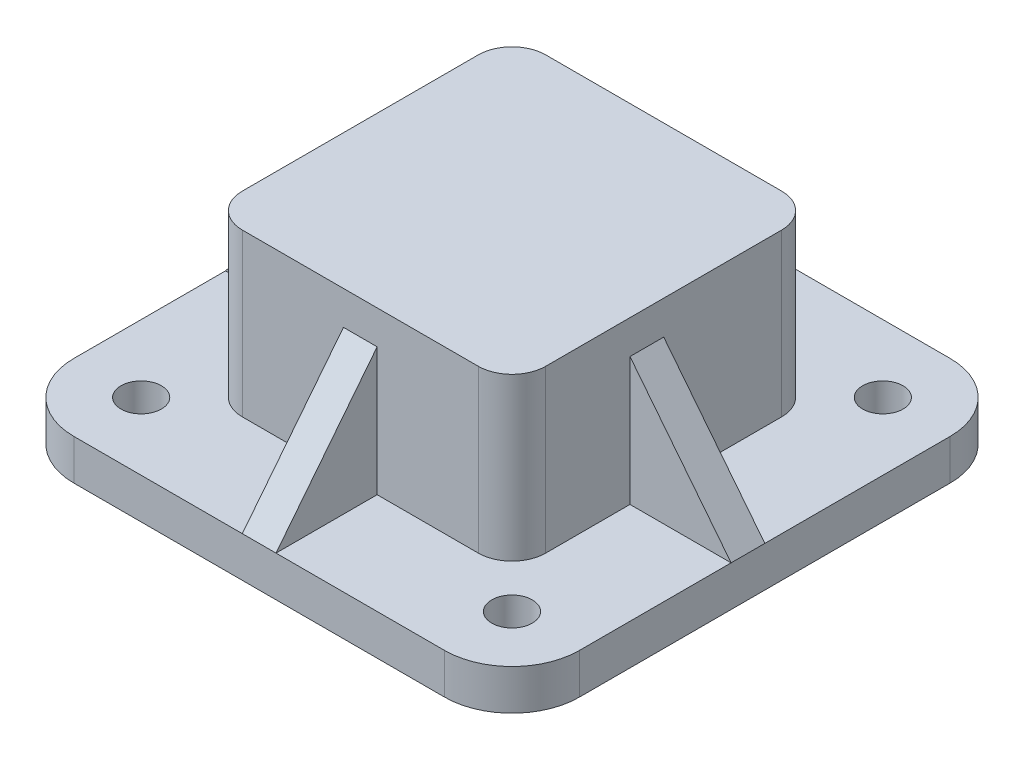
ISO-10303-21;
HEADER;
FILE_DESCRIPTION(('STEP AP214'),'2;1');
FILE_NAME('part.step','',(''),(''),'','','');
FILE_SCHEMA(('AUTOMOTIVE_DESIGN { 1 0 10303 214 1 1 1 1 }'));
ENDSEC;
DATA;
#1=APPLICATION_CONTEXT('core data for automotive mechanical design processes');
#2=APPLICATION_PROTOCOL_DEFINITION('international standard','automotive_design',2000,#1);
#3=PRODUCT_CONTEXT('',#1,'mechanical');
#4=PRODUCT('Part','Part','',(#3));
#5=PRODUCT_RELATED_PRODUCT_CATEGORY('part','',(#4));
#6=PRODUCT_DEFINITION_FORMATION('','',#4);
#7=PRODUCT_DEFINITION_CONTEXT('part definition',#1,'design');
#8=PRODUCT_DEFINITION('design','',#6,#7);
#9=PRODUCT_DEFINITION_SHAPE('','',#8);
#10=(LENGTH_UNIT() NAMED_UNIT(*) SI_UNIT(.MILLI.,.METRE.));
#11=(NAMED_UNIT(*) PLANE_ANGLE_UNIT() SI_UNIT($,.RADIAN.));
#12=(NAMED_UNIT(*) SI_UNIT($,.STERADIAN.) SOLID_ANGLE_UNIT());
#13=UNCERTAINTY_MEASURE_WITH_UNIT(LENGTH_MEASURE(1.E-05),#10,'distance_accuracy_value','');
#14=(GEOMETRIC_REPRESENTATION_CONTEXT(3) GLOBAL_UNCERTAINTY_ASSIGNED_CONTEXT((#13)) GLOBAL_UNIT_ASSIGNED_CONTEXT((#10,
#11,#12)) REPRESENTATION_CONTEXT('',''));
#15=CARTESIAN_POINT('',(0.,0.,0.));
#16=DIRECTION('',(0.,0.,1.));
#17=DIRECTION('',(1.,0.,0.));
#18=AXIS2_PLACEMENT_3D('',#15,#16,#17);
#19=CARTESIAN_POINT('',(55.,12.,-55.));
#20=DIRECTION('',(0.,1.,0.));
#21=DIRECTION('',(0.,0.,1.));
#22=AXIS2_PLACEMENT_3D('',#19,#20,#21);
#23=PLANE('',#22);
#24=CARTESIAN_POINT('',(-55.,12.,-55.));
#25=DIRECTION('',(0.,1.,0.));
#26=DIRECTION('',(0.,0.,1.));
#27=AXIS2_PLACEMENT_3D('',#24,#25,#26);
#28=CIRCLE('',#27,6.);
#29=CARTESIAN_POINT('',(-55.,12.,-49.));
#30=VERTEX_POINT('',#29);
#31=EDGE_CURVE('E398',#30,#30,#28,.T.);
#32=ORIENTED_EDGE('',*,*,#31,.F.);
#33=EDGE_LOOP('',(#32));
#34=FACE_BOUND('',#33,.T.);
#35=DIRECTION('',(0.,0.,1.));
#36=VECTOR('',#35,1.);
#37=CARTESIAN_POINT('',(-75.,12.,-54.9999999999998));
#38=LINE('',#37,#36);
#39=CARTESIAN_POINT('',(-75.,12.,-54.9999999999998));
#40=VERTEX_POINT('',#39);
#41=CARTESIAN_POINT('',(-75.,12.,0.));
#42=VERTEX_POINT('',#41);
#43=EDGE_CURVE('E234',#40,#42,#38,.T.);
#44=ORIENTED_EDGE('',*,*,#43,.T.);
#45=DIRECTION('',(-1.,0.,0.));
#46=VECTOR('',#45,1.);
#47=CARTESIAN_POINT('',(-45.,12.,0.));
#48=LINE('',#47,#46);
#49=CARTESIAN_POINT('',(-45.,12.,0.));
#50=VERTEX_POINT('',#49);
#51=EDGE_CURVE('E233',#50,#42,#48,.T.);
#52=ORIENTED_EDGE('',*,*,#51,.F.);
#53=DIRECTION('',(0.,0.,1.));
#54=VECTOR('',#53,1.);
#55=CARTESIAN_POINT('',(-45.,12.,-34.9999999999999));
#56=LINE('',#55,#54);
#57=CARTESIAN_POINT('',(-45.,12.,-34.9999999999999));
#58=VERTEX_POINT('',#57);
#59=EDGE_CURVE('E219',#58,#50,#56,.T.);
#60=ORIENTED_EDGE('',*,*,#59,.F.);
#61=CARTESIAN_POINT('',(-35.,12.,-35.));
#62=DIRECTION('',(0.,-1.,0.));
#63=DIRECTION('',(0.,0.,-1.));
#64=AXIS2_PLACEMENT_3D('',#61,#62,#63);
#65=CIRCLE('',#64,10.);
#66=CARTESIAN_POINT('',(-34.9999999999999,12.,-45.));
#67=VERTEX_POINT('',#66);
#68=EDGE_CURVE('E315',#58,#67,#65,.T.);
#69=ORIENTED_EDGE('',*,*,#68,.T.);
#70=DIRECTION('',(1.,0.,0.));
#71=VECTOR('',#70,1.);
#72=CARTESIAN_POINT('',(-34.9999999999999,12.,-45.));
#73=LINE('',#72,#71);
#74=CARTESIAN_POINT('',(-5.,12.,-45.));
#75=VERTEX_POINT('',#74);
#76=EDGE_CURVE('E338',#67,#75,#73,.T.);
#77=ORIENTED_EDGE('',*,*,#76,.T.);
#78=DIRECTION('',(0.,0.,-1.));
#79=VECTOR('',#78,1.);
#80=CARTESIAN_POINT('',(-5.,12.,-45.));
#81=LINE('',#80,#79);
#82=CARTESIAN_POINT('',(-5.,12.,-75.));
#83=VERTEX_POINT('',#82);
#84=EDGE_CURVE('E299',#75,#83,#81,.T.);
#85=ORIENTED_EDGE('',*,*,#84,.T.);
#86=DIRECTION('',(-1.,0.,0.));
#87=VECTOR('',#86,1.);
#88=CARTESIAN_POINT('',(-54.9999999999999,12.,-75.));
#89=LINE('',#88,#87);
#90=CARTESIAN_POINT('',(-55.,12.,-75.));
#91=VERTEX_POINT('',#90);
#92=EDGE_CURVE('E407',#83,#91,#89,.T.);
#93=ORIENTED_EDGE('',*,*,#92,.T.);
#94=CARTESIAN_POINT('',(-55.,12.,-55.));
#95=DIRECTION('',(0.,1.,0.));
#96=DIRECTION('',(0.,0.,-1.));
#97=AXIS2_PLACEMENT_3D('',#94,#95,#96);
#98=CIRCLE('',#97,20.);
#99=EDGE_CURVE('E412',#91,#40,#98,.T.);
#100=ORIENTED_EDGE('',*,*,#99,.T.);
#101=EDGE_LOOP('',(#44,#52,#60,#69,#77,#85,#93,#100));
#102=FACE_BOUND('',#101,.T.);
#103=ADVANCED_FACE('F33',(#34,#102),#23,.T.);
#104=CARTESIAN_POINT('',(55.,12.,-55.));
#105=DIRECTION('',(0.,1.,0.));
#106=DIRECTION('',(0.,0.,1.));
#107=AXIS2_PLACEMENT_3D('',#104,#105,#106);
#108=CIRCLE('',#107,6.);
#109=CARTESIAN_POINT('',(55.,12.,-49.));
#110=VERTEX_POINT('',#109);
#111=EDGE_CURVE('E380',#110,#110,#108,.T.);
#112=ORIENTED_EDGE('',*,*,#111,.F.);
#113=EDGE_LOOP('',(#112));
#114=FACE_BOUND('',#113,.T.);
#115=DIRECTION('',(0.,0.,1.));
#116=VECTOR('',#115,1.);
#117=CARTESIAN_POINT('',(45.,12.,-34.9999999999999));
#118=LINE('',#117,#116);
#119=CARTESIAN_POINT('',(45.,12.,-34.9999999999999));
#120=VERTEX_POINT('',#119);
#121=CARTESIAN_POINT('',(45.,12.,0.));
#122=VERTEX_POINT('',#121);
#123=EDGE_CURVE('E345',#120,#122,#118,.T.);
#124=ORIENTED_EDGE('',*,*,#123,.T.);
#125=DIRECTION('',(-1.,0.,0.));
#126=VECTOR('',#125,1.);
#127=CARTESIAN_POINT('',(75.,12.,0.));
#128=LINE('',#127,#126);
#129=CARTESIAN_POINT('',(75.,12.,0.));
#130=VERTEX_POINT('',#129);
#131=EDGE_CURVE('E258',#130,#122,#128,.T.);
#132=ORIENTED_EDGE('',*,*,#131,.F.);
#133=DIRECTION('',(0.,0.,-1.));
#134=VECTOR('',#133,1.);
#135=CARTESIAN_POINT('',(75.,12.,-54.9999999999998));
#136=LINE('',#135,#134);
#137=CARTESIAN_POINT('',(75.,12.,-54.9999999999998));
#138=VERTEX_POINT('',#137);
#139=EDGE_CURVE('E424',#130,#138,#136,.T.);
#140=ORIENTED_EDGE('',*,*,#139,.T.);
#141=CARTESIAN_POINT('',(55.,12.,-55.));
#142=DIRECTION('',(0.,1.,0.));
#143=DIRECTION('',(0.,0.,1.));
#144=AXIS2_PLACEMENT_3D('',#141,#142,#143);
#145=CIRCLE('',#144,20.);
#146=CARTESIAN_POINT('',(54.9999999999998,12.,-75.));
#147=VERTEX_POINT('',#146);
#148=EDGE_CURVE('E404',#138,#147,#145,.T.);
#149=ORIENTED_EDGE('',*,*,#148,.T.);
#150=CARTESIAN_POINT('',(5.,12.,-75.));
#151=VERTEX_POINT('',#150);
#152=EDGE_CURVE('E409',#147,#151,#89,.T.);
#153=ORIENTED_EDGE('',*,*,#152,.T.);
#154=DIRECTION('',(0.,0.,-1.));
#155=VECTOR('',#154,1.);
#156=CARTESIAN_POINT('',(5.,12.,-45.));
#157=LINE('',#156,#155);
#158=CARTESIAN_POINT('',(5.,12.,-45.));
#159=VERTEX_POINT('',#158);
#160=EDGE_CURVE('E302',#159,#151,#157,.T.);
#161=ORIENTED_EDGE('',*,*,#160,.F.);
#162=CARTESIAN_POINT('',(34.9999999999999,12.,-45.));
#163=VERTEX_POINT('',#162);
#164=EDGE_CURVE('E337',#159,#163,#73,.T.);
#165=ORIENTED_EDGE('',*,*,#164,.T.);
#166=CARTESIAN_POINT('',(35.,12.,-35.));
#167=DIRECTION('',(0.,1.,0.));
#168=DIRECTION('',(0.,0.,1.));
#169=AXIS2_PLACEMENT_3D('',#166,#167,#168);
#170=CIRCLE('',#169,10.);
#171=EDGE_CURVE('E341',#120,#163,#170,.T.);
#172=ORIENTED_EDGE('',*,*,#171,.F.);
#173=EDGE_LOOP('',(#124,#132,#140,#149,#153,#161,#165,#172));
#174=FACE_BOUND('',#173,.T.);
#175=ADVANCED_FACE('F515',(#114,#174),#23,.T.);
#176=DIRECTION('',(-1.,0.,0.));
#177=VECTOR('',#176,1.);
#178=CARTESIAN_POINT('',(75.,12.,10.));
#179=LINE('',#178,#177);
#180=CARTESIAN_POINT('',(75.,12.,10.));
#181=VERTEX_POINT('',#180);
#182=CARTESIAN_POINT('',(45.,12.,10.));
#183=VERTEX_POINT('',#182);
#184=EDGE_CURVE('E260',#181,#183,#179,.T.);
#185=ORIENTED_EDGE('',*,*,#184,.T.);
#186=CARTESIAN_POINT('',(45.,12.,34.9999999999999));
#187=VERTEX_POINT('',#186);
#188=EDGE_CURVE('E344',#183,#187,#118,.T.);
#189=ORIENTED_EDGE('',*,*,#188,.T.);
#190=CARTESIAN_POINT('',(35.,12.,35.));
#191=DIRECTION('',(0.,1.,0.));
#192=DIRECTION('',(0.,0.,1.));
#193=AXIS2_PLACEMENT_3D('',#190,#191,#192);
#194=CIRCLE('',#193,10.);
#195=CARTESIAN_POINT('',(35.,12.,45.));
#196=VERTEX_POINT('',#195);
#197=EDGE_CURVE('E348',#196,#187,#194,.T.);
#198=ORIENTED_EDGE('',*,*,#197,.F.);
#199=DIRECTION('',(1.,0.,0.));
#200=VECTOR('',#199,1.);
#201=CARTESIAN_POINT('',(-34.9999999999999,12.,45.));
#202=LINE('',#201,#200);
#203=CARTESIAN_POINT('',(5.,12.,45.));
#204=VERTEX_POINT('',#203);
#205=EDGE_CURVE('E351',#204,#196,#202,.T.);
#206=ORIENTED_EDGE('',*,*,#205,.F.);
#207=DIRECTION('',(0.,0.,-1.));
#208=VECTOR('',#207,1.);
#209=CARTESIAN_POINT('',(5.,12.,45.));
#210=LINE('',#209,#208);
#211=CARTESIAN_POINT('',(5.,12.,75.));
#212=VERTEX_POINT('',#211);
#213=EDGE_CURVE('E281',#212,#204,#210,.T.);
#214=ORIENTED_EDGE('',*,*,#213,.F.);
#215=DIRECTION('',(1.,0.,0.));
#216=VECTOR('',#215,1.);
#217=CARTESIAN_POINT('',(-54.9999999999999,12.,75.));
#218=LINE('',#217,#216);
#219=CARTESIAN_POINT('',(54.9999999999998,12.,75.));
#220=VERTEX_POINT('',#219);
#221=EDGE_CURVE('E418',#212,#220,#218,.T.);
#222=ORIENTED_EDGE('',*,*,#221,.T.);
#223=CARTESIAN_POINT('',(55.,12.,55.));
#224=DIRECTION('',(0.,1.,0.));
#225=DIRECTION('',(0.,0.,1.));
#226=AXIS2_PLACEMENT_3D('',#223,#224,#225);
#227=CIRCLE('',#226,20.);
#228=CARTESIAN_POINT('',(75.,12.,54.9999999999999));
#229=VERTEX_POINT('',#228);
#230=EDGE_CURVE('E422',#220,#229,#227,.T.);
#231=ORIENTED_EDGE('',*,*,#230,.T.);
#232=EDGE_CURVE('E425',#229,#181,#136,.T.);
#233=ORIENTED_EDGE('',*,*,#232,.T.);
#234=EDGE_LOOP('',(#185,#189,#198,#206,#214,#222,#231,#233));
#235=FACE_BOUND('',#234,.T.);
#236=CARTESIAN_POINT('',(55.,12.,55.));
#237=DIRECTION('',(0.,1.,0.));
#238=DIRECTION('',(0.,0.,1.));
#239=AXIS2_PLACEMENT_3D('',#236,#237,#238);
#240=CIRCLE('',#239,6.);
#241=CARTESIAN_POINT('',(55.,12.,61.));
#242=VERTEX_POINT('',#241);
#243=EDGE_CURVE('E386',#242,#242,#240,.T.);
#244=ORIENTED_EDGE('',*,*,#243,.F.);
#245=EDGE_LOOP('',(#244));
#246=FACE_BOUND('',#245,.T.);
#247=ADVANCED_FACE('F549',(#235,#246),#23,.T.);
#248=CARTESIAN_POINT('',(-34.9999999999999,60.,45.));
#249=DIRECTION('',(0.,0.,-1.));
#250=DIRECTION('',(-1.,0.,0.));
#251=AXIS2_PLACEMENT_3D('',#248,#249,#250);
#252=PLANE('',#251);
#253=DIRECTION('',(0.,1.,0.));
#254=VECTOR('',#253,1.);
#255=CARTESIAN_POINT('',(5.,50.,45.));
#256=LINE('',#255,#254);
#257=CARTESIAN_POINT('',(5.,50.,45.));
#258=VERTEX_POINT('',#257);
#259=EDGE_CURVE('E275',#204,#258,#256,.T.);
#260=ORIENTED_EDGE('',*,*,#259,.F.);
#261=ORIENTED_EDGE('',*,*,#205,.T.);
#262=DIRECTION('',(0.,-1.,0.));
#263=VECTOR('',#262,1.);
#264=CARTESIAN_POINT('',(34.9999999999999,60.,45.));
#265=LINE('',#264,#263);
#266=CARTESIAN_POINT('',(34.9999999999999,60.,45.));
#267=VERTEX_POINT('',#266);
#268=EDGE_CURVE('E366',#267,#196,#265,.T.);
#269=ORIENTED_EDGE('',*,*,#268,.F.);
#270=DIRECTION('',(1.,0.,0.));
#271=VECTOR('',#270,1.);
#272=CARTESIAN_POINT('',(-34.9999999999999,60.,45.));
#273=LINE('',#272,#271);
#274=CARTESIAN_POINT('',(-34.9999999999999,60.,45.));
#275=VERTEX_POINT('',#274);
#276=EDGE_CURVE('E328',#275,#267,#273,.T.);
#277=ORIENTED_EDGE('',*,*,#276,.F.);
#278=DIRECTION('',(0.,-1.,0.));
#279=VECTOR('',#278,1.);
#280=CARTESIAN_POINT('',(-34.9999999999999,60.,45.));
#281=LINE('',#280,#279);
#282=CARTESIAN_POINT('',(-34.9999999999999,12.,45.));
#283=VERTEX_POINT('',#282);
#284=EDGE_CURVE('E363',#275,#283,#281,.T.);
#285=ORIENTED_EDGE('',*,*,#284,.T.);
#286=CARTESIAN_POINT('',(-5.,12.,45.));
#287=VERTEX_POINT('',#286);
#288=EDGE_CURVE('E352',#283,#287,#202,.T.);
#289=ORIENTED_EDGE('',*,*,#288,.T.);
#290=DIRECTION('',(0.,1.,0.));
#291=VECTOR('',#290,1.);
#292=CARTESIAN_POINT('',(-5.,50.,45.));
#293=LINE('',#292,#291);
#294=CARTESIAN_POINT('',(-5.,50.,45.));
#295=VERTEX_POINT('',#294);
#296=EDGE_CURVE('E272',#287,#295,#293,.T.);
#297=ORIENTED_EDGE('',*,*,#296,.T.);
#298=DIRECTION('',(-1.,0.,0.));
#299=VECTOR('',#298,1.);
#300=CARTESIAN_POINT('',(5.,50.,45.));
#301=LINE('',#300,#299);
#302=EDGE_CURVE('E292',#258,#295,#301,.T.);
#303=ORIENTED_EDGE('',*,*,#302,.F.);
#304=EDGE_LOOP('',(#260,#261,#269,#277,#285,#289,#297,#303));
#305=FACE_BOUND('',#304,.T.);
#306=ADVANCED_FACE('F568',(#305),#252,.F.);
#307=DIRECTION('',(-1.,0.,0.));
#308=VECTOR('',#307,1.);
#309=CARTESIAN_POINT('',(-45.,12.,10.));
#310=LINE('',#309,#308);
#311=CARTESIAN_POINT('',(-45.,12.,10.));
#312=VERTEX_POINT('',#311);
#313=CARTESIAN_POINT('',(-75.,12.,9.99999999999999));
#314=VERTEX_POINT('',#313);
#315=EDGE_CURVE('E48',#312,#314,#310,.T.);
#316=ORIENTED_EDGE('',*,*,#315,.T.);
#317=CARTESIAN_POINT('',(-75.,12.,54.9999999999999));
#318=VERTEX_POINT('',#317);
#319=EDGE_CURVE('E414',#314,#318,#38,.T.);
#320=ORIENTED_EDGE('',*,*,#319,.T.);
#321=CARTESIAN_POINT('',(-55.,12.,55.));
#322=DIRECTION('',(0.,1.,0.));
#323=DIRECTION('',(0.,0.,-1.));
#324=AXIS2_PLACEMENT_3D('',#321,#322,#323);
#325=CIRCLE('',#324,20.);
#326=CARTESIAN_POINT('',(-54.9999999999999,12.,75.));
#327=VERTEX_POINT('',#326);
#328=EDGE_CURVE('E416',#318,#327,#325,.T.);
#329=ORIENTED_EDGE('',*,*,#328,.T.);
#330=CARTESIAN_POINT('',(-5.,12.,75.));
#331=VERTEX_POINT('',#330);
#332=EDGE_CURVE('E419',#327,#331,#218,.T.);
#333=ORIENTED_EDGE('',*,*,#332,.T.);
#334=DIRECTION('',(0.,0.,-1.));
#335=VECTOR('',#334,1.);
#336=CARTESIAN_POINT('',(-5.,12.,45.));
#337=LINE('',#336,#335);
#338=EDGE_CURVE('E279',#331,#287,#337,.T.);
#339=ORIENTED_EDGE('',*,*,#338,.T.);
#340=ORIENTED_EDGE('',*,*,#288,.F.);
#341=CARTESIAN_POINT('',(-35.,12.,35.));
#342=DIRECTION('',(0.,-1.,0.));
#343=DIRECTION('',(0.,0.,-1.));
#344=AXIS2_PLACEMENT_3D('',#341,#342,#343);
#345=CIRCLE('',#344,9.99999999999999);
#346=CARTESIAN_POINT('',(-45.,12.,34.9999999999999));
#347=VERTEX_POINT('',#346);
#348=EDGE_CURVE('E355',#283,#347,#345,.T.);
#349=ORIENTED_EDGE('',*,*,#348,.T.);
#350=EDGE_CURVE('E230',#312,#347,#56,.T.);
#351=ORIENTED_EDGE('',*,*,#350,.F.);
#352=EDGE_LOOP('',(#316,#320,#329,#333,#339,#340,#349,#351));
#353=FACE_BOUND('',#352,.T.);
#354=CARTESIAN_POINT('',(-55.,12.,55.));
#355=DIRECTION('',(0.,1.,0.));
#356=DIRECTION('',(0.,0.,1.));
#357=AXIS2_PLACEMENT_3D('',#354,#355,#356);
#358=CIRCLE('',#357,5.99999999999999);
#359=CARTESIAN_POINT('',(-55.,12.,61.));
#360=VERTEX_POINT('',#359);
#361=EDGE_CURVE('E392',#360,#360,#358,.T.);
#362=ORIENTED_EDGE('',*,*,#361,.F.);
#363=EDGE_LOOP('',(#362));
#364=FACE_BOUND('',#363,.T.);
#365=ADVANCED_FACE('F483',(#353,#364),#23,.T.);
#366=CARTESIAN_POINT('',(-34.9999999999999,60.,-45.));
#367=DIRECTION('',(0.,0.,-1.));
#368=DIRECTION('',(-1.,0.,0.));
#369=AXIS2_PLACEMENT_3D('',#366,#367,#368);
#370=PLANE('',#369);
#371=ORIENTED_EDGE('',*,*,#164,.F.);
#372=DIRECTION('',(0.,-1.,0.));
#373=VECTOR('',#372,1.);
#374=CARTESIAN_POINT('',(5.,50.,-45.));
#375=LINE('',#374,#373);
#376=CARTESIAN_POINT('',(5.,50.,-45.));
#377=VERTEX_POINT('',#376);
#378=EDGE_CURVE('E298',#377,#159,#375,.T.);
#379=ORIENTED_EDGE('',*,*,#378,.F.);
#380=DIRECTION('',(-1.,0.,0.));
#381=VECTOR('',#380,1.);
#382=CARTESIAN_POINT('',(5.,50.,-45.));
#383=LINE('',#382,#381);
#384=CARTESIAN_POINT('',(-5.,50.,-45.));
#385=VERTEX_POINT('',#384);
#386=EDGE_CURVE('E313',#377,#385,#383,.T.);
#387=ORIENTED_EDGE('',*,*,#386,.T.);
#388=DIRECTION('',(0.,-1.,0.));
#389=VECTOR('',#388,1.);
#390=CARTESIAN_POINT('',(-5.,50.,-45.));
#391=LINE('',#390,#389);
#392=EDGE_CURVE('E308',#385,#75,#391,.T.);
#393=ORIENTED_EDGE('',*,*,#392,.T.);
#394=ORIENTED_EDGE('',*,*,#76,.F.);
#395=DIRECTION('',(0.,-1.,0.));
#396=VECTOR('',#395,1.);
#397=CARTESIAN_POINT('',(-34.9999999999999,60.,-45.));
#398=LINE('',#397,#396);
#399=CARTESIAN_POINT('',(-34.9999999999999,60.,-45.));
#400=VERTEX_POINT('',#399);
#401=EDGE_CURVE('E335',#400,#67,#398,.T.);
#402=ORIENTED_EDGE('',*,*,#401,.F.);
#403=DIRECTION('',(1.,0.,0.));
#404=VECTOR('',#403,1.);
#405=CARTESIAN_POINT('',(-34.9999999999999,60.,-45.));
#406=LINE('',#405,#404);
#407=CARTESIAN_POINT('',(34.9999999999999,60.,-45.));
#408=VERTEX_POINT('',#407);
#409=EDGE_CURVE('E318',#400,#408,#406,.T.);
#410=ORIENTED_EDGE('',*,*,#409,.T.);
#411=DIRECTION('',(0.,-1.,0.));
#412=VECTOR('',#411,1.);
#413=CARTESIAN_POINT('',(34.9999999999999,60.,-45.));
#414=LINE('',#413,#412);
#415=EDGE_CURVE('E375',#408,#163,#414,.T.);
#416=ORIENTED_EDGE('',*,*,#415,.T.);
#417=EDGE_LOOP('',(#371,#379,#387,#393,#394,#402,#410,#416));
#418=FACE_BOUND('',#417,.T.);
#419=ADVANCED_FACE('F521',(#418),#370,.T.);
#420=CARTESIAN_POINT('',(55.,0.,-55.));
#421=DIRECTION('',(0.,1.,0.));
#422=DIRECTION('',(0.,0.,1.));
#423=AXIS2_PLACEMENT_3D('',#420,#421,#422);
#424=PLANE('',#423);
#425=CARTESIAN_POINT('',(55.,0.,-55.));
#426=DIRECTION('',(0.,1.,0.));
#427=DIRECTION('',(0.,0.,1.));
#428=AXIS2_PLACEMENT_3D('',#425,#426,#427);
#429=CIRCLE('',#428,20.);
#430=CARTESIAN_POINT('',(75.,0.,-54.9999999999998));
#431=VERTEX_POINT('',#430);
#432=CARTESIAN_POINT('',(54.9999999999998,0.,-75.));
#433=VERTEX_POINT('',#432);
#434=EDGE_CURVE('E401',#431,#433,#429,.T.);
#435=ORIENTED_EDGE('',*,*,#434,.F.);
#436=DIRECTION('',(0.,0.,-1.));
#437=VECTOR('',#436,1.);
#438=CARTESIAN_POINT('',(75.,0.,-54.9999999999998));
#439=LINE('',#438,#437);
#440=CARTESIAN_POINT('',(75.,0.,54.9999999999999));
#441=VERTEX_POINT('',#440);
#442=EDGE_CURVE('E408',#441,#431,#439,.T.);
#443=ORIENTED_EDGE('',*,*,#442,.F.);
#444=CARTESIAN_POINT('',(55.,0.,55.));
#445=DIRECTION('',(0.,1.,0.));
#446=DIRECTION('',(0.,0.,1.));
#447=AXIS2_PLACEMENT_3D('',#444,#445,#446);
#448=CIRCLE('',#447,20.);
#449=CARTESIAN_POINT('',(54.9999999999998,0.,75.));
#450=VERTEX_POINT('',#449);
#451=EDGE_CURVE('E441',#450,#441,#448,.T.);
#452=ORIENTED_EDGE('',*,*,#451,.F.);
#453=DIRECTION('',(1.,0.,0.));
#454=VECTOR('',#453,1.);
#455=CARTESIAN_POINT('',(-54.9999999999999,0.,75.));
#456=LINE('',#455,#454);
#457=CARTESIAN_POINT('',(-54.9999999999999,0.,75.));
#458=VERTEX_POINT('',#457);
#459=EDGE_CURVE('E439',#458,#450,#456,.T.);
#460=ORIENTED_EDGE('',*,*,#459,.F.);
#461=CARTESIAN_POINT('',(-55.,0.,55.));
#462=DIRECTION('',(0.,1.,0.));
#463=DIRECTION('',(0.,0.,-1.));
#464=AXIS2_PLACEMENT_3D('',#461,#462,#463);
#465=CIRCLE('',#464,20.);
#466=CARTESIAN_POINT('',(-75.,0.,54.9999999999999));
#467=VERTEX_POINT('',#466);
#468=EDGE_CURVE('E437',#467,#458,#465,.T.);
#469=ORIENTED_EDGE('',*,*,#468,.F.);
#470=DIRECTION('',(0.,0.,1.));
#471=VECTOR('',#470,1.);
#472=CARTESIAN_POINT('',(-75.,0.,-54.9999999999998));
#473=LINE('',#472,#471);
#474=CARTESIAN_POINT('',(-75.,0.,-54.9999999999998));
#475=VERTEX_POINT('',#474);
#476=EDGE_CURVE('E435',#475,#467,#473,.T.);
#477=ORIENTED_EDGE('',*,*,#476,.F.);
#478=CARTESIAN_POINT('',(-55.,0.,-55.));
#479=DIRECTION('',(0.,1.,0.));
#480=DIRECTION('',(0.,0.,-1.));
#481=AXIS2_PLACEMENT_3D('',#478,#479,#480);
#482=CIRCLE('',#481,20.);
#483=CARTESIAN_POINT('',(-55.,0.,-75.));
#484=VERTEX_POINT('',#483);
#485=EDGE_CURVE('E433',#484,#475,#482,.T.);
#486=ORIENTED_EDGE('',*,*,#485,.F.);
#487=DIRECTION('',(-1.,0.,0.));
#488=VECTOR('',#487,1.);
#489=CARTESIAN_POINT('',(-54.9999999999999,0.,-75.));
#490=LINE('',#489,#488);
#491=EDGE_CURVE('E431',#433,#484,#490,.T.);
#492=ORIENTED_EDGE('',*,*,#491,.F.);
#493=EDGE_LOOP('',(#435,#443,#452,#460,#469,#477,#486,#492));
#494=FACE_BOUND('',#493,.T.);
#495=CARTESIAN_POINT('',(-55.,0.,-55.));
#496=DIRECTION('',(0.,1.,0.));
#497=DIRECTION('',(0.,0.,1.));
#498=AXIS2_PLACEMENT_3D('',#495,#496,#497);
#499=CIRCLE('',#498,6.);
#500=CARTESIAN_POINT('',(-55.,0.,-49.));
#501=VERTEX_POINT('',#500);
#502=EDGE_CURVE('E395',#501,#501,#499,.T.);
#503=ORIENTED_EDGE('',*,*,#502,.T.);
#504=EDGE_LOOP('',(#503));
#505=FACE_BOUND('',#504,.T.);
#506=CARTESIAN_POINT('',(-55.,0.,55.));
#507=DIRECTION('',(0.,1.,0.));
#508=DIRECTION('',(0.,0.,1.));
#509=AXIS2_PLACEMENT_3D('',#506,#507,#508);
#510=CIRCLE('',#509,5.99999999999999);
#511=CARTESIAN_POINT('',(-55.,0.,61.));
#512=VERTEX_POINT('',#511);
#513=EDGE_CURVE('E389',#512,#512,#510,.T.);
#514=ORIENTED_EDGE('',*,*,#513,.T.);
#515=EDGE_LOOP('',(#514));
#516=FACE_BOUND('',#515,.T.);
#517=CARTESIAN_POINT('',(55.,0.,55.));
#518=DIRECTION('',(0.,1.,0.));
#519=DIRECTION('',(0.,0.,1.));
#520=AXIS2_PLACEMENT_3D('',#517,#518,#519);
#521=CIRCLE('',#520,6.);
#522=CARTESIAN_POINT('',(55.,0.,61.));
#523=VERTEX_POINT('',#522);
#524=EDGE_CURVE('E383',#523,#523,#521,.T.);
#525=ORIENTED_EDGE('',*,*,#524,.T.);
#526=EDGE_LOOP('',(#525));
#527=FACE_BOUND('',#526,.T.);
#528=CARTESIAN_POINT('',(55.,0.,-55.));
#529=DIRECTION('',(0.,1.,0.));
#530=DIRECTION('',(0.,0.,1.));
#531=AXIS2_PLACEMENT_3D('',#528,#529,#530);
#532=CIRCLE('',#531,6.);
#533=CARTESIAN_POINT('',(55.,0.,-49.));
#534=VERTEX_POINT('',#533);
#535=EDGE_CURVE('E359',#534,#534,#532,.T.);
#536=ORIENTED_EDGE('',*,*,#535,.T.);
#537=EDGE_LOOP('',(#536));
#538=FACE_BOUND('',#537,.T.);
#539=ADVANCED_FACE('F472',(#494,#505,#516,#527,#538),#424,.F.);
#540=CARTESIAN_POINT('',(55.,12.,-55.));
#541=DIRECTION('',(0.,-1.,0.));
#542=DIRECTION('',(0.,0.,-1.));
#543=AXIS2_PLACEMENT_3D('',#540,#541,#542);
#544=CYLINDRICAL_SURFACE('',#543,20.);
#545=ORIENTED_EDGE('',*,*,#434,.T.);
#546=DIRECTION('',(0.,-1.,0.));
#547=VECTOR('',#546,1.);
#548=CARTESIAN_POINT('',(54.9999999999998,12.,-75.));
#549=LINE('',#548,#547);
#550=EDGE_CURVE('E11',#147,#433,#549,.T.);
#551=ORIENTED_EDGE('',*,*,#550,.F.);
#552=ORIENTED_EDGE('',*,*,#148,.F.);
#553=DIRECTION('',(0.,-1.,0.));
#554=VECTOR('',#553,1.);
#555=CARTESIAN_POINT('',(75.,12.,-54.9999999999998));
#556=LINE('',#555,#554);
#557=EDGE_CURVE('E428',#138,#431,#556,.T.);
#558=ORIENTED_EDGE('',*,*,#557,.T.);
#559=EDGE_LOOP('',(#545,#551,#552,#558));
#560=FACE_BOUND('',#559,.T.);
#561=ADVANCED_FACE('F35',(#560),#544,.T.);
#562=CARTESIAN_POINT('',(-54.9999999999999,12.,-75.));
#563=DIRECTION('',(0.,0.,1.));
#564=DIRECTION('',(1.,0.,0.));
#565=AXIS2_PLACEMENT_3D('',#562,#563,#564);
#566=PLANE('',#565);
#567=ORIENTED_EDGE('',*,*,#491,.T.);
#568=DIRECTION('',(0.,-1.,0.));
#569=VECTOR('',#568,1.);
#570=CARTESIAN_POINT('',(-55.,12.,-75.));
#571=LINE('',#570,#569);
#572=EDGE_CURVE('E41',#91,#484,#571,.T.);
#573=ORIENTED_EDGE('',*,*,#572,.F.);
#574=ORIENTED_EDGE('',*,*,#92,.F.);
#575=DIRECTION('',(-1.,0.,0.));
#576=VECTOR('',#575,1.);
#577=CARTESIAN_POINT('',(5.,12.,-75.));
#578=LINE('',#577,#576);
#579=EDGE_CURVE('E305',#151,#83,#578,.T.);
#580=ORIENTED_EDGE('',*,*,#579,.F.);
#581=ORIENTED_EDGE('',*,*,#152,.F.);
#582=ORIENTED_EDGE('',*,*,#550,.T.);
#583=EDGE_LOOP('',(#567,#573,#574,#580,#581,#582));
#584=FACE_BOUND('',#583,.T.);
#585=ADVANCED_FACE('F513',(#584),#566,.F.);
#586=CARTESIAN_POINT('',(-55.,12.,-55.));
#587=DIRECTION('',(0.,-1.,0.));
#588=DIRECTION('',(0.,0.,-1.));
#589=AXIS2_PLACEMENT_3D('',#586,#587,#588);
#590=CYLINDRICAL_SURFACE('',#589,20.);
#591=ORIENTED_EDGE('',*,*,#485,.T.);
#592=DIRECTION('',(0.,-1.,0.));
#593=VECTOR('',#592,1.);
#594=CARTESIAN_POINT('',(-75.,12.,-54.9999999999998));
#595=LINE('',#594,#593);
#596=EDGE_CURVE('E458',#40,#475,#595,.T.);
#597=ORIENTED_EDGE('',*,*,#596,.F.);
#598=ORIENTED_EDGE('',*,*,#99,.F.);
#599=ORIENTED_EDGE('',*,*,#572,.T.);
#600=EDGE_LOOP('',(#591,#597,#598,#599));
#601=FACE_BOUND('',#600,.T.);
#602=ADVANCED_FACE('F465',(#601),#590,.T.);
#603=CARTESIAN_POINT('',(-75.,12.,-54.9999999999998));
#604=DIRECTION('',(1.,0.,0.));
#605=DIRECTION('',(0.,0.,-1.));
#606=AXIS2_PLACEMENT_3D('',#603,#604,#605);
#607=PLANE('',#606);
#608=ORIENTED_EDGE('',*,*,#476,.T.);
#609=DIRECTION('',(0.,-1.,0.));
#610=VECTOR('',#609,1.);
#611=CARTESIAN_POINT('',(-75.,12.,54.9999999999999));
#612=LINE('',#611,#610);
#613=EDGE_CURVE('E455',#318,#467,#612,.T.);
#614=ORIENTED_EDGE('',*,*,#613,.F.);
#615=ORIENTED_EDGE('',*,*,#319,.F.);
#616=DIRECTION('',(0.,0.,-1.));
#617=VECTOR('',#616,1.);
#618=CARTESIAN_POINT('',(-75.,12.,10.));
#619=LINE('',#618,#617);
#620=EDGE_CURVE('E55',#314,#42,#619,.T.);
#621=ORIENTED_EDGE('',*,*,#620,.T.);
#622=ORIENTED_EDGE('',*,*,#43,.F.);
#623=ORIENTED_EDGE('',*,*,#596,.T.);
#624=EDGE_LOOP('',(#608,#614,#615,#621,#622,#623));
#625=FACE_BOUND('',#624,.T.);
#626=ADVANCED_FACE('F477',(#625),#607,.F.);
#627=CARTESIAN_POINT('',(-55.,12.,55.));
#628=DIRECTION('',(0.,-1.,0.));
#629=DIRECTION('',(0.,0.,-1.));
#630=AXIS2_PLACEMENT_3D('',#627,#628,#629);
#631=CYLINDRICAL_SURFACE('',#630,20.);
#632=ORIENTED_EDGE('',*,*,#468,.T.);
#633=DIRECTION('',(0.,-1.,0.));
#634=VECTOR('',#633,1.);
#635=CARTESIAN_POINT('',(-54.9999999999999,12.,75.));
#636=LINE('',#635,#634);
#637=EDGE_CURVE('E452',#327,#458,#636,.T.);
#638=ORIENTED_EDGE('',*,*,#637,.F.);
#639=ORIENTED_EDGE('',*,*,#328,.F.);
#640=ORIENTED_EDGE('',*,*,#613,.T.);
#641=EDGE_LOOP('',(#632,#638,#639,#640));
#642=FACE_BOUND('',#641,.T.);
#643=ADVANCED_FACE('F480',(#642),#631,.T.);
#644=CARTESIAN_POINT('',(-54.9999999999999,12.,75.));
#645=DIRECTION('',(0.,0.,-1.));
#646=DIRECTION('',(-1.,0.,0.));
#647=AXIS2_PLACEMENT_3D('',#644,#645,#646);
#648=PLANE('',#647);
#649=ORIENTED_EDGE('',*,*,#459,.T.);
#650=DIRECTION('',(0.,-1.,0.));
#651=VECTOR('',#650,1.);
#652=CARTESIAN_POINT('',(54.9999999999998,12.,75.));
#653=LINE('',#652,#651);
#654=EDGE_CURVE('E449',#220,#450,#653,.T.);
#655=ORIENTED_EDGE('',*,*,#654,.F.);
#656=ORIENTED_EDGE('',*,*,#221,.F.);
#657=DIRECTION('',(-1.,0.,0.));
#658=VECTOR('',#657,1.);
#659=CARTESIAN_POINT('',(5.,12.,75.));
#660=LINE('',#659,#658);
#661=EDGE_CURVE('E283',#212,#331,#660,.T.);
#662=ORIENTED_EDGE('',*,*,#661,.T.);
#663=ORIENTED_EDGE('',*,*,#332,.F.);
#664=ORIENTED_EDGE('',*,*,#637,.T.);
#665=EDGE_LOOP('',(#649,#655,#656,#662,#663,#664));
#666=FACE_BOUND('',#665,.T.);
#667=ADVANCED_FACE('F557',(#666),#648,.F.);
#668=CARTESIAN_POINT('',(55.,12.,55.));
#669=DIRECTION('',(0.,-1.,0.));
#670=DIRECTION('',(0.,0.,-1.));
#671=AXIS2_PLACEMENT_3D('',#668,#669,#670);
#672=CYLINDRICAL_SURFACE('',#671,20.);
#673=ORIENTED_EDGE('',*,*,#451,.T.);
#674=DIRECTION('',(0.,-1.,0.));
#675=VECTOR('',#674,1.);
#676=CARTESIAN_POINT('',(75.,12.,54.9999999999999));
#677=LINE('',#676,#675);
#678=EDGE_CURVE('E446',#229,#441,#677,.T.);
#679=ORIENTED_EDGE('',*,*,#678,.F.);
#680=ORIENTED_EDGE('',*,*,#230,.F.);
#681=ORIENTED_EDGE('',*,*,#654,.T.);
#682=EDGE_LOOP('',(#673,#679,#680,#681));
#683=FACE_BOUND('',#682,.T.);
#684=ADVANCED_FACE('F545',(#683),#672,.T.);
#685=CARTESIAN_POINT('',(75.,12.,-54.9999999999998));
#686=DIRECTION('',(-1.,0.,0.));
#687=DIRECTION('',(0.,0.,1.));
#688=AXIS2_PLACEMENT_3D('',#685,#686,#687);
#689=PLANE('',#688);
#690=ORIENTED_EDGE('',*,*,#442,.T.);
#691=ORIENTED_EDGE('',*,*,#557,.F.);
#692=ORIENTED_EDGE('',*,*,#139,.F.);
#693=DIRECTION('',(0.,0.,-1.));
#694=VECTOR('',#693,1.);
#695=CARTESIAN_POINT('',(75.,12.,10.));
#696=LINE('',#695,#694);
#697=EDGE_CURVE('E270',#181,#130,#696,.T.);
#698=ORIENTED_EDGE('',*,*,#697,.F.);
#699=ORIENTED_EDGE('',*,*,#232,.F.);
#700=ORIENTED_EDGE('',*,*,#678,.T.);
#701=EDGE_LOOP('',(#690,#691,#692,#698,#699,#700));
#702=FACE_BOUND('',#701,.T.);
#703=ADVANCED_FACE('F538',(#702),#689,.F.);
#704=CARTESIAN_POINT('',(-55.,12.,-55.));
#705=DIRECTION('',(0.,-1.,0.));
#706=DIRECTION('',(0.,0.,-1.));
#707=AXIS2_PLACEMENT_3D('',#704,#705,#706);
#708=CYLINDRICAL_SURFACE('',#707,6.);
#709=ORIENTED_EDGE('',*,*,#31,.T.);
#710=EDGE_LOOP('',(#709));
#711=FACE_BOUND('',#710,.T.);
#712=ORIENTED_EDGE('',*,*,#502,.F.);
#713=EDGE_LOOP('',(#712));
#714=FACE_BOUND('',#713,.T.);
#715=ADVANCED_FACE('F782',(#711,#714),#708,.F.);
#716=CARTESIAN_POINT('',(-55.,12.,55.));
#717=DIRECTION('',(0.,-1.,0.));
#718=DIRECTION('',(0.,0.,-1.));
#719=AXIS2_PLACEMENT_3D('',#716,#717,#718);
#720=CYLINDRICAL_SURFACE('',#719,5.99999999999999);
#721=ORIENTED_EDGE('',*,*,#361,.T.);
#722=EDGE_LOOP('',(#721));
#723=FACE_BOUND('',#722,.T.);
#724=ORIENTED_EDGE('',*,*,#513,.F.);
#725=EDGE_LOOP('',(#724));
#726=FACE_BOUND('',#725,.T.);
#727=ADVANCED_FACE('F818',(#723,#726),#720,.F.);
#728=CARTESIAN_POINT('',(55.,12.,55.));
#729=DIRECTION('',(0.,-1.,0.));
#730=DIRECTION('',(0.,0.,-1.));
#731=AXIS2_PLACEMENT_3D('',#728,#729,#730);
#732=CYLINDRICAL_SURFACE('',#731,6.);
#733=ORIENTED_EDGE('',*,*,#243,.T.);
#734=EDGE_LOOP('',(#733));
#735=FACE_BOUND('',#734,.T.);
#736=ORIENTED_EDGE('',*,*,#524,.F.);
#737=EDGE_LOOP('',(#736));
#738=FACE_BOUND('',#737,.T.);
#739=ADVANCED_FACE('F827',(#735,#738),#732,.F.);
#740=CARTESIAN_POINT('',(55.,12.,-55.));
#741=DIRECTION('',(0.,-1.,0.));
#742=DIRECTION('',(0.,0.,-1.));
#743=AXIS2_PLACEMENT_3D('',#740,#741,#742);
#744=CYLINDRICAL_SURFACE('',#743,6.);
#745=ORIENTED_EDGE('',*,*,#111,.T.);
#746=EDGE_LOOP('',(#745));
#747=FACE_BOUND('',#746,.T.);
#748=ORIENTED_EDGE('',*,*,#535,.F.);
#749=EDGE_LOOP('',(#748));
#750=FACE_BOUND('',#749,.T.);
#751=ADVANCED_FACE('F837',(#747,#750),#744,.F.);
#752=CARTESIAN_POINT('',(-35.,60.,-35.));
#753=DIRECTION('',(0.,-1.,0.));
#754=DIRECTION('',(0.,0.,-1.));
#755=AXIS2_PLACEMENT_3D('',#752,#753,#754);
#756=CYLINDRICAL_SURFACE('',#755,10.);
#757=ORIENTED_EDGE('',*,*,#68,.F.);
#758=DIRECTION('',(0.,-1.,0.));
#759=VECTOR('',#758,1.);
#760=CARTESIAN_POINT('',(-45.,60.,-34.9999999999999));
#761=LINE('',#760,#759);
#762=CARTESIAN_POINT('',(-45.,60.,-34.9999999999999));
#763=VERTEX_POINT('',#762);
#764=EDGE_CURVE('E226',#763,#58,#761,.T.);
#765=ORIENTED_EDGE('',*,*,#764,.F.);
#766=CARTESIAN_POINT('',(-35.,60.,-35.));
#767=DIRECTION('',(0.,-1.,0.));
#768=DIRECTION('',(0.,0.,-1.));
#769=AXIS2_PLACEMENT_3D('',#766,#767,#768);
#770=CIRCLE('',#769,10.);
#771=EDGE_CURVE('E229',#763,#400,#770,.T.);
#772=ORIENTED_EDGE('',*,*,#771,.T.);
#773=ORIENTED_EDGE('',*,*,#401,.T.);
#774=EDGE_LOOP('',(#757,#765,#772,#773));
#775=FACE_BOUND('',#774,.T.);
#776=ADVANCED_FACE('F501',(#775),#756,.T.);
#777=CARTESIAN_POINT('',(-45.,60.,-34.9999999999999));
#778=DIRECTION('',(1.,0.,0.));
#779=DIRECTION('',(0.,0.,-1.));
#780=AXIS2_PLACEMENT_3D('',#777,#778,#779);
#781=PLANE('',#780);
#782=DIRECTION('',(0.,0.,-1.));
#783=VECTOR('',#782,1.);
#784=CARTESIAN_POINT('',(-45.,50.,10.));
#785=LINE('',#784,#783);
#786=CARTESIAN_POINT('',(-45.,50.,10.));
#787=VERTEX_POINT('',#786);
#788=CARTESIAN_POINT('',(-45.,50.,0.));
#789=VERTEX_POINT('',#788);
#790=EDGE_CURVE('E247',#787,#789,#785,.T.);
#791=ORIENTED_EDGE('',*,*,#790,.F.);
#792=DIRECTION('',(0.,-1.,0.));
#793=VECTOR('',#792,1.);
#794=CARTESIAN_POINT('',(-45.,50.,10.));
#795=LINE('',#794,#793);
#796=EDGE_CURVE('E250',#787,#312,#795,.T.);
#797=ORIENTED_EDGE('',*,*,#796,.T.);
#798=ORIENTED_EDGE('',*,*,#350,.T.);
#799=DIRECTION('',(0.,-1.,0.));
#800=VECTOR('',#799,1.);
#801=CARTESIAN_POINT('',(-45.,60.,34.9999999999999));
#802=LINE('',#801,#800);
#803=CARTESIAN_POINT('',(-45.,60.,34.9999999999999));
#804=VERTEX_POINT('',#803);
#805=EDGE_CURVE('E360',#804,#347,#802,.T.);
#806=ORIENTED_EDGE('',*,*,#805,.F.);
#807=DIRECTION('',(0.,0.,1.));
#808=VECTOR('',#807,1.);
#809=CARTESIAN_POINT('',(-45.,60.,-34.9999999999999));
#810=LINE('',#809,#808);
#811=EDGE_CURVE('E333',#763,#804,#810,.T.);
#812=ORIENTED_EDGE('',*,*,#811,.F.);
#813=ORIENTED_EDGE('',*,*,#764,.T.);
#814=ORIENTED_EDGE('',*,*,#59,.T.);
#815=DIRECTION('',(0.,-1.,0.));
#816=VECTOR('',#815,1.);
#817=CARTESIAN_POINT('',(-45.,50.,0.));
#818=LINE('',#817,#816);
#819=EDGE_CURVE('E223',#789,#50,#818,.T.);
#820=ORIENTED_EDGE('',*,*,#819,.F.);
#821=EDGE_LOOP('',(#791,#797,#798,#806,#812,#813,#814,#820));
#822=FACE_BOUND('',#821,.T.);
#823=ADVANCED_FACE('F221',(#822),#781,.F.);
#824=CARTESIAN_POINT('',(-35.,60.,35.));
#825=DIRECTION('',(0.,-1.,0.));
#826=DIRECTION('',(0.,0.,-1.));
#827=AXIS2_PLACEMENT_3D('',#824,#825,#826);
#828=CYLINDRICAL_SURFACE('',#827,9.99999999999999);
#829=ORIENTED_EDGE('',*,*,#348,.F.);
#830=ORIENTED_EDGE('',*,*,#284,.F.);
#831=CARTESIAN_POINT('',(-35.,60.,35.));
#832=DIRECTION('',(0.,-1.,0.));
#833=DIRECTION('',(0.,0.,-1.));
#834=AXIS2_PLACEMENT_3D('',#831,#832,#833);
#835=CIRCLE('',#834,9.99999999999999);
#836=EDGE_CURVE('E330',#275,#804,#835,.T.);
#837=ORIENTED_EDGE('',*,*,#836,.T.);
#838=ORIENTED_EDGE('',*,*,#805,.T.);
#839=EDGE_LOOP('',(#829,#830,#837,#838));
#840=FACE_BOUND('',#839,.T.);
#841=ADVANCED_FACE('F494',(#840),#828,.T.);
#842=CARTESIAN_POINT('',(35.,60.,35.));
#843=DIRECTION('',(0.,-1.,0.));
#844=DIRECTION('',(0.,0.,-1.));
#845=AXIS2_PLACEMENT_3D('',#842,#843,#844);
#846=CYLINDRICAL_SURFACE('',#845,10.);
#847=ORIENTED_EDGE('',*,*,#197,.T.);
#848=DIRECTION('',(0.,-1.,0.));
#849=VECTOR('',#848,1.);
#850=CARTESIAN_POINT('',(45.,60.,34.9999999999999));
#851=LINE('',#850,#849);
#852=CARTESIAN_POINT('',(45.,60.,34.9999999999999));
#853=VERTEX_POINT('',#852);
#854=EDGE_CURVE('E369',#853,#187,#851,.T.);
#855=ORIENTED_EDGE('',*,*,#854,.F.);
#856=CARTESIAN_POINT('',(35.,60.,35.));
#857=DIRECTION('',(0.,1.,0.));
#858=DIRECTION('',(0.,0.,1.));
#859=AXIS2_PLACEMENT_3D('',#856,#857,#858);
#860=CIRCLE('',#859,10.);
#861=EDGE_CURVE('E326',#267,#853,#860,.T.);
#862=ORIENTED_EDGE('',*,*,#861,.F.);
#863=ORIENTED_EDGE('',*,*,#268,.T.);
#864=EDGE_LOOP('',(#847,#855,#862,#863));
#865=FACE_BOUND('',#864,.T.);
#866=ADVANCED_FACE('F574',(#865),#846,.T.);
#867=CARTESIAN_POINT('',(45.,60.,-34.9999999999999));
#868=DIRECTION('',(1.,0.,0.));
#869=DIRECTION('',(0.,0.,-1.));
#870=AXIS2_PLACEMENT_3D('',#867,#868,#869);
#871=PLANE('',#870);
#872=DIRECTION('',(0.,1.,0.));
#873=VECTOR('',#872,1.);
#874=CARTESIAN_POINT('',(45.,12.,10.));
#875=LINE('',#874,#873);
#876=CARTESIAN_POINT('',(45.,50.,10.));
#877=VERTEX_POINT('',#876);
#878=EDGE_CURVE('E254',#183,#877,#875,.T.);
#879=ORIENTED_EDGE('',*,*,#878,.T.);
#880=DIRECTION('',(0.,0.,-1.));
#881=VECTOR('',#880,1.);
#882=CARTESIAN_POINT('',(45.,50.,10.));
#883=LINE('',#882,#881);
#884=CARTESIAN_POINT('',(45.,50.,0.));
#885=VERTEX_POINT('',#884);
#886=EDGE_CURVE('E263',#877,#885,#883,.T.);
#887=ORIENTED_EDGE('',*,*,#886,.T.);
#888=DIRECTION('',(0.,1.,0.));
#889=VECTOR('',#888,1.);
#890=CARTESIAN_POINT('',(45.,12.,0.));
#891=LINE('',#890,#889);
#892=EDGE_CURVE('E238',#122,#885,#891,.T.);
#893=ORIENTED_EDGE('',*,*,#892,.F.);
#894=ORIENTED_EDGE('',*,*,#123,.F.);
#895=DIRECTION('',(0.,-1.,0.));
#896=VECTOR('',#895,1.);
#897=CARTESIAN_POINT('',(45.,60.,-34.9999999999999));
#898=LINE('',#897,#896);
#899=CARTESIAN_POINT('',(45.,60.,-34.9999999999999));
#900=VERTEX_POINT('',#899);
#901=EDGE_CURVE('E372',#900,#120,#898,.T.);
#902=ORIENTED_EDGE('',*,*,#901,.F.);
#903=DIRECTION('',(0.,0.,1.));
#904=VECTOR('',#903,1.);
#905=CARTESIAN_POINT('',(45.,60.,-34.9999999999999));
#906=LINE('',#905,#904);
#907=EDGE_CURVE('E323',#900,#853,#906,.T.);
#908=ORIENTED_EDGE('',*,*,#907,.T.);
#909=ORIENTED_EDGE('',*,*,#854,.T.);
#910=ORIENTED_EDGE('',*,*,#188,.F.);
#911=EDGE_LOOP('',(#879,#887,#893,#894,#902,#908,#909,#910));
#912=FACE_BOUND('',#911,.T.);
#913=ADVANCED_FACE('F531',(#912),#871,.T.);
#914=CARTESIAN_POINT('',(35.,60.,-35.));
#915=DIRECTION('',(0.,-1.,0.));
#916=DIRECTION('',(0.,0.,-1.));
#917=AXIS2_PLACEMENT_3D('',#914,#915,#916);
#918=CYLINDRICAL_SURFACE('',#917,10.);
#919=ORIENTED_EDGE('',*,*,#171,.T.);
#920=ORIENTED_EDGE('',*,*,#415,.F.);
#921=CARTESIAN_POINT('',(35.,60.,-35.));
#922=DIRECTION('',(0.,1.,0.));
#923=DIRECTION('',(0.,0.,1.));
#924=AXIS2_PLACEMENT_3D('',#921,#922,#923);
#925=CIRCLE('',#924,10.);
#926=EDGE_CURVE('E321',#900,#408,#925,.T.);
#927=ORIENTED_EDGE('',*,*,#926,.F.);
#928=ORIENTED_EDGE('',*,*,#901,.T.);
#929=EDGE_LOOP('',(#919,#920,#927,#928));
#930=FACE_BOUND('',#929,.T.);
#931=ADVANCED_FACE('F527',(#930),#918,.T.);
#932=CARTESIAN_POINT('',(-35.,60.,-35.));
#933=DIRECTION('',(0.,-1.,0.));
#934=DIRECTION('',(0.,0.,-1.));
#935=AXIS2_PLACEMENT_3D('',#932,#933,#934);
#936=PLANE('',#935);
#937=ORIENTED_EDGE('',*,*,#771,.F.);
#938=ORIENTED_EDGE('',*,*,#811,.T.);
#939=ORIENTED_EDGE('',*,*,#836,.F.);
#940=ORIENTED_EDGE('',*,*,#276,.T.);
#941=ORIENTED_EDGE('',*,*,#861,.T.);
#942=ORIENTED_EDGE('',*,*,#907,.F.);
#943=ORIENTED_EDGE('',*,*,#926,.T.);
#944=ORIENTED_EDGE('',*,*,#409,.F.);
#945=EDGE_LOOP('',(#937,#938,#939,#940,#941,#942,#943,#944));
#946=FACE_BOUND('',#945,.T.);
#947=ADVANCED_FACE('F499',(#946),#936,.F.);
#948=CARTESIAN_POINT('',(5.,12.,-75.));
#949=DIRECTION('',(0.,-0.61964428857902,0.784882765533426));
#950=DIRECTION('',(0.,-0.784882765533426,-0.61964428857902));
#951=AXIS2_PLACEMENT_3D('',#948,#949,#950);
#952=PLANE('',#951);
#953=DIRECTION('',(0.,0.784882765533426,0.61964428857902));
#954=VECTOR('',#953,1.);
#955=CARTESIAN_POINT('',(-5.,12.,-75.));
#956=LINE('',#955,#954);
#957=EDGE_CURVE('E294',#83,#385,#956,.T.);
#958=ORIENTED_EDGE('',*,*,#957,.T.);
#959=ORIENTED_EDGE('',*,*,#386,.F.);
#960=DIRECTION('',(0.,0.784882765533426,0.61964428857902));
#961=VECTOR('',#960,1.);
#962=CARTESIAN_POINT('',(5.,12.,-75.));
#963=LINE('',#962,#961);
#964=EDGE_CURVE('E295',#151,#377,#963,.T.);
#965=ORIENTED_EDGE('',*,*,#964,.F.);
#966=ORIENTED_EDGE('',*,*,#579,.T.);
#967=EDGE_LOOP('',(#958,#959,#965,#966));
#968=FACE_BOUND('',#967,.T.);
#969=ADVANCED_FACE('F511',(#968),#952,.F.);
#970=CARTESIAN_POINT('',(5.,0.,0.));
#971=DIRECTION('',(-1.,0.,0.));
#972=DIRECTION('',(0.,0.,1.));
#973=AXIS2_PLACEMENT_3D('',#970,#971,#972);
#974=PLANE('',#973);
#975=ORIENTED_EDGE('',*,*,#964,.T.);
#976=ORIENTED_EDGE('',*,*,#378,.T.);
#977=ORIENTED_EDGE('',*,*,#160,.T.);
#978=EDGE_LOOP('',(#975,#976,#977));
#979=FACE_BOUND('',#978,.T.);
#980=ADVANCED_FACE('F520',(#979),#974,.F.);
#981=CARTESIAN_POINT('',(-5.,0.,0.));
#982=DIRECTION('',(-1.,0.,0.));
#983=DIRECTION('',(0.,0.,1.));
#984=AXIS2_PLACEMENT_3D('',#981,#982,#983);
#985=PLANE('',#984);
#986=ORIENTED_EDGE('',*,*,#957,.F.);
#987=ORIENTED_EDGE('',*,*,#84,.F.);
#988=ORIENTED_EDGE('',*,*,#392,.F.);
#989=EDGE_LOOP('',(#986,#987,#988));
#990=FACE_BOUND('',#989,.T.);
#991=ADVANCED_FACE('F508',(#990),#985,.T.);
#992=CARTESIAN_POINT('',(5.,12.,75.));
#993=DIRECTION('',(0.,-0.61964428857902,-0.784882765533426));
#994=DIRECTION('',(0.,0.784882765533426,-0.61964428857902));
#995=AXIS2_PLACEMENT_3D('',#992,#993,#994);
#996=PLANE('',#995);
#997=DIRECTION('',(0.,-0.784882765533426,0.61964428857902));
#998=VECTOR('',#997,1.);
#999=CARTESIAN_POINT('',(-5.,12.,75.));
#1000=LINE('',#999,#998);
#1001=EDGE_CURVE('E286',#295,#331,#1000,.T.);
#1002=ORIENTED_EDGE('',*,*,#1001,.T.);
#1003=ORIENTED_EDGE('',*,*,#661,.F.);
#1004=DIRECTION('',(0.,-0.784882765533426,0.61964428857902));
#1005=VECTOR('',#1004,1.);
#1006=CARTESIAN_POINT('',(5.,12.,75.));
#1007=LINE('',#1006,#1005);
#1008=EDGE_CURVE('E278',#258,#212,#1007,.T.);
#1009=ORIENTED_EDGE('',*,*,#1008,.F.);
#1010=ORIENTED_EDGE('',*,*,#302,.T.);
#1011=EDGE_LOOP('',(#1002,#1003,#1009,#1010));
#1012=FACE_BOUND('',#1011,.T.);
#1013=ADVANCED_FACE('F560',(#1012),#996,.F.);
#1014=CARTESIAN_POINT('',(5.,0.,0.));
#1015=DIRECTION('',(-1.,0.,0.));
#1016=DIRECTION('',(0.,0.,1.));
#1017=AXIS2_PLACEMENT_3D('',#1014,#1015,#1016);
#1018=PLANE('',#1017);
#1019=ORIENTED_EDGE('',*,*,#259,.T.);
#1020=ORIENTED_EDGE('',*,*,#1008,.T.);
#1021=ORIENTED_EDGE('',*,*,#213,.T.);
#1022=EDGE_LOOP('',(#1019,#1020,#1021));
#1023=FACE_BOUND('',#1022,.T.);
#1024=ADVANCED_FACE('F577',(#1023),#1018,.F.);
#1025=CARTESIAN_POINT('',(-5.,0.,0.));
#1026=DIRECTION('',(-1.,0.,0.));
#1027=DIRECTION('',(0.,0.,1.));
#1028=AXIS2_PLACEMENT_3D('',#1025,#1026,#1027);
#1029=PLANE('',#1028);
#1030=ORIENTED_EDGE('',*,*,#296,.F.);
#1031=ORIENTED_EDGE('',*,*,#338,.F.);
#1032=ORIENTED_EDGE('',*,*,#1001,.F.);
#1033=EDGE_LOOP('',(#1030,#1031,#1032));
#1034=FACE_BOUND('',#1033,.T.);
#1035=ADVANCED_FACE('F565',(#1034),#1029,.T.);
#1036=CARTESIAN_POINT('',(45.,50.,10.));
#1037=DIRECTION('',(0.784882765533426,0.619644288579021,0.));
#1038=DIRECTION('',(-0.619644288579021,0.784882765533426,0.));
#1039=AXIS2_PLACEMENT_3D('',#1036,#1037,#1038);
#1040=PLANE('',#1039);
#1041=DIRECTION('',(0.619644288579021,-0.784882765533426,0.));
#1042=VECTOR('',#1041,1.);
#1043=CARTESIAN_POINT('',(45.,50.,0.));
#1044=LINE('',#1043,#1042);
#1045=EDGE_CURVE('E266',#885,#130,#1044,.T.);
#1046=ORIENTED_EDGE('',*,*,#1045,.F.);
#1047=ORIENTED_EDGE('',*,*,#886,.F.);
#1048=DIRECTION('',(0.619644288579021,-0.784882765533426,0.));
#1049=VECTOR('',#1048,1.);
#1050=CARTESIAN_POINT('',(45.,50.,10.));
#1051=LINE('',#1050,#1049);
#1052=EDGE_CURVE('E257',#877,#181,#1051,.T.);
#1053=ORIENTED_EDGE('',*,*,#1052,.T.);
#1054=ORIENTED_EDGE('',*,*,#697,.T.);
#1055=EDGE_LOOP('',(#1046,#1047,#1053,#1054));
#1056=FACE_BOUND('',#1055,.T.);
#1057=ADVANCED_FACE('F584',(#1056),#1040,.T.);
#1058=CARTESIAN_POINT('',(0.,0.,10.));
#1059=DIRECTION('',(0.,0.,1.));
#1060=DIRECTION('',(1.,0.,0.));
#1061=AXIS2_PLACEMENT_3D('',#1058,#1059,#1060);
#1062=PLANE('',#1061);
#1063=ORIENTED_EDGE('',*,*,#878,.F.);
#1064=ORIENTED_EDGE('',*,*,#184,.F.);
#1065=ORIENTED_EDGE('',*,*,#1052,.F.);
#1066=EDGE_LOOP('',(#1063,#1064,#1065));
#1067=FACE_BOUND('',#1066,.T.);
#1068=ADVANCED_FACE('F708',(#1067),#1062,.T.);
#1069=CARTESIAN_POINT('',(0.,0.,0.));
#1070=DIRECTION('',(0.,0.,1.));
#1071=DIRECTION('',(1.,0.,0.));
#1072=AXIS2_PLACEMENT_3D('',#1069,#1070,#1071);
#1073=PLANE('',#1072);
#1074=ORIENTED_EDGE('',*,*,#892,.T.);
#1075=ORIENTED_EDGE('',*,*,#1045,.T.);
#1076=ORIENTED_EDGE('',*,*,#131,.T.);
#1077=EDGE_LOOP('',(#1074,#1075,#1076));
#1078=FACE_BOUND('',#1077,.T.);
#1079=ADVANCED_FACE('F533',(#1078),#1073,.F.);
#1080=CARTESIAN_POINT('',(-75.,12.,10.));
#1081=DIRECTION('',(-0.784882765533426,0.619644288579021,0.));
#1082=DIRECTION('',(-0.619644288579021,-0.784882765533426,0.));
#1083=AXIS2_PLACEMENT_3D('',#1080,#1081,#1082);
#1084=PLANE('',#1083);
#1085=DIRECTION('',(0.619644288579021,0.784882765533426,0.));
#1086=VECTOR('',#1085,1.);
#1087=CARTESIAN_POINT('',(-75.,12.,0.));
#1088=LINE('',#1087,#1086);
#1089=EDGE_CURVE('E239',#42,#789,#1088,.T.);
#1090=ORIENTED_EDGE('',*,*,#1089,.F.);
#1091=ORIENTED_EDGE('',*,*,#620,.F.);
#1092=DIRECTION('',(0.619644288579021,0.784882765533426,0.));
#1093=VECTOR('',#1092,1.);
#1094=CARTESIAN_POINT('',(-75.,12.,10.));
#1095=LINE('',#1094,#1093);
#1096=EDGE_CURVE('E244',#314,#787,#1095,.T.);
#1097=ORIENTED_EDGE('',*,*,#1096,.T.);
#1098=ORIENTED_EDGE('',*,*,#790,.T.);
#1099=EDGE_LOOP('',(#1090,#1091,#1097,#1098));
#1100=FACE_BOUND('',#1099,.T.);
#1101=ADVANCED_FACE('F487',(#1100),#1084,.T.);
#1102=CARTESIAN_POINT('',(0.,0.,10.));
#1103=DIRECTION('',(0.,0.,1.));
#1104=DIRECTION('',(1.,0.,0.));
#1105=AXIS2_PLACEMENT_3D('',#1102,#1103,#1104);
#1106=PLANE('',#1105);
#1107=ORIENTED_EDGE('',*,*,#315,.F.);
#1108=ORIENTED_EDGE('',*,*,#796,.F.);
#1109=ORIENTED_EDGE('',*,*,#1096,.F.);
#1110=EDGE_LOOP('',(#1107,#1108,#1109));
#1111=FACE_BOUND('',#1110,.T.);
#1112=ADVANCED_FACE('F490',(#1111),#1106,.T.);
#1113=CARTESIAN_POINT('',(0.,0.,0.));
#1114=DIRECTION('',(0.,0.,1.));
#1115=DIRECTION('',(1.,0.,0.));
#1116=AXIS2_PLACEMENT_3D('',#1113,#1114,#1115);
#1117=PLANE('',#1116);
#1118=ORIENTED_EDGE('',*,*,#51,.T.);
#1119=ORIENTED_EDGE('',*,*,#1089,.T.);
#1120=ORIENTED_EDGE('',*,*,#819,.T.);
#1121=EDGE_LOOP('',(#1118,#1119,#1120));
#1122=FACE_BOUND('',#1121,.T.);
#1123=ADVANCED_FACE('F241',(#1122),#1117,.F.);
#1124=CLOSED_SHELL('',(#103,#175,#247,#306,#365,#419,#539,#561,#585,#602,#626,#643,#667,#684,
#703,#715,#727,#739,#751,#776,#823,#841,#866,#913,#931,#947,#969,#980,#991,#1013,#1024,#1035,
#1057,#1068,#1079,#1101,#1112,#1123));
#1125=MANIFOLD_SOLID_BREP('B2',#1124);
#1126=ADVANCED_BREP_SHAPE_REPRESENTATION('',(#18,#1125),#14);
#1127=SHAPE_DEFINITION_REPRESENTATION(#9,#1126);
ENDSEC;
END-ISO-10303-21;
